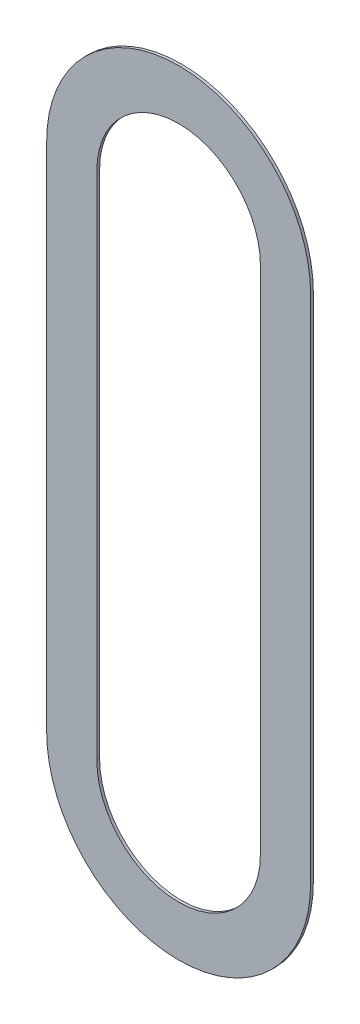
ISO-10303-21;
HEADER;
FILE_DESCRIPTION(('STEP AP214'),'2;1');
FILE_NAME('part.step','',(''),(''),'','','');
FILE_SCHEMA(('AUTOMOTIVE_DESIGN { 1 0 10303 214 1 1 1 1 }'));
ENDSEC;
DATA;
#1=APPLICATION_CONTEXT('core data for automotive mechanical design processes');
#2=APPLICATION_PROTOCOL_DEFINITION('international standard','automotive_design',2000,#1);
#3=PRODUCT_CONTEXT('',#1,'mechanical');
#4=PRODUCT('Part','Part','',(#3));
#5=PRODUCT_RELATED_PRODUCT_CATEGORY('part','',(#4));
#6=PRODUCT_DEFINITION_FORMATION('','',#4);
#7=PRODUCT_DEFINITION_CONTEXT('part definition',#1,'design');
#8=PRODUCT_DEFINITION('design','',#6,#7);
#9=PRODUCT_DEFINITION_SHAPE('','',#8);
#10=(LENGTH_UNIT() NAMED_UNIT(*) SI_UNIT(.MILLI.,.METRE.));
#11=(NAMED_UNIT(*) PLANE_ANGLE_UNIT() SI_UNIT($,.RADIAN.));
#12=(NAMED_UNIT(*) SI_UNIT($,.STERADIAN.) SOLID_ANGLE_UNIT());
#13=UNCERTAINTY_MEASURE_WITH_UNIT(LENGTH_MEASURE(1.E-05),#10,'distance_accuracy_value','');
#14=(GEOMETRIC_REPRESENTATION_CONTEXT(3) GLOBAL_UNCERTAINTY_ASSIGNED_CONTEXT((#13)) GLOBAL_UNIT_ASSIGNED_CONTEXT((#10,
#11,#12)) REPRESENTATION_CONTEXT('',''));
#15=CARTESIAN_POINT('',(0.,0.,0.));
#16=DIRECTION('',(0.,0.,1.));
#17=DIRECTION('',(1.,0.,0.));
#18=AXIS2_PLACEMENT_3D('',#15,#16,#17);
#19=CARTESIAN_POINT('',(23.6397617344236,2.37961452822477,0.));
#20=DIRECTION('',(0.,0.,-1.));
#21=DIRECTION('',(0.,-1.,0.));
#22=AXIS2_PLACEMENT_3D('',#19,#20,#21);
#23=PLANE('',#22);
#24=CARTESIAN_POINT('',(23.6397617344236,1.91565363741156,0.));
#25=DIRECTION('',(0.,0.,1.));
#26=DIRECTION('',(1.,0.,0.));
#27=AXIS2_PLACEMENT_3D('',#24,#25,#26);
#28=CIRCLE('',#27,0.148519109942367);
#29=CARTESIAN_POINT('',(23.4912426244812,1.91565363741156,0.));
#30=VERTEX_POINT('',#29);
#31=CARTESIAN_POINT('',(23.7882808443659,1.91565363741156,0.));
#32=VERTEX_POINT('',#31);
#33=EDGE_CURVE('E57',#30,#32,#28,.T.);
#34=ORIENTED_EDGE('',*,*,#33,.F.);
#35=DIRECTION('',(0.,-1.,0.));
#36=VECTOR('',#35,1.);
#37=CARTESIAN_POINT('',(23.4912426244812,1.91565363741156,0.));
#38=LINE('',#37,#36);
#39=CARTESIAN_POINT('',(23.4912426244812,2.84357541903797,0.));
#40=VERTEX_POINT('',#39);
#41=EDGE_CURVE('E19',#40,#30,#38,.T.);
#42=ORIENTED_EDGE('',*,*,#41,.F.);
#43=CARTESIAN_POINT('',(23.6397617344236,2.84357541903797,0.));
#44=DIRECTION('',(0.,0.,1.));
#45=DIRECTION('',(-1.,0.,0.));
#46=AXIS2_PLACEMENT_3D('',#43,#44,#45);
#47=CIRCLE('',#46,0.148519109942367);
#48=CARTESIAN_POINT('',(23.7882808443659,2.84357541903797,0.));
#49=VERTEX_POINT('',#48);
#50=EDGE_CURVE('E104',#49,#40,#47,.T.);
#51=ORIENTED_EDGE('',*,*,#50,.F.);
#52=DIRECTION('',(0.,1.,0.));
#53=VECTOR('',#52,1.);
#54=CARTESIAN_POINT('',(23.7882808443659,2.84357541903797,0.));
#55=LINE('',#54,#53);
#56=EDGE_CURVE('E155',#32,#49,#55,.T.);
#57=ORIENTED_EDGE('',*,*,#56,.F.);
#58=EDGE_LOOP('',(#34,#42,#51,#57));
#59=FACE_BOUND('',#58,.T.);
#60=CARTESIAN_POINT('',(23.6397617344236,1.91565363741156,0.));
#61=DIRECTION('',(0.,0.,-1.));
#62=DIRECTION('',(1.,0.,0.));
#63=AXIS2_PLACEMENT_3D('',#60,#61,#62);
#64=CIRCLE('',#63,0.239762257454337);
#65=CARTESIAN_POINT('',(23.8795239918779,1.91565363741156,0.));
#66=VERTEX_POINT('',#65);
#67=CARTESIAN_POINT('',(23.3999994769692,1.91565363741156,0.));
#68=VERTEX_POINT('',#67);
#69=EDGE_CURVE('E26',#66,#68,#64,.T.);
#70=ORIENTED_EDGE('',*,*,#69,.F.);
#71=DIRECTION('',(0.,-1.,0.));
#72=VECTOR('',#71,1.);
#73=CARTESIAN_POINT('',(23.8795239918779,2.84357541903797,0.));
#74=LINE('',#73,#72);
#75=CARTESIAN_POINT('',(23.8795239918779,2.84357541903797,0.));
#76=VERTEX_POINT('',#75);
#77=EDGE_CURVE('E146',#76,#66,#74,.T.);
#78=ORIENTED_EDGE('',*,*,#77,.F.);
#79=CARTESIAN_POINT('',(23.6397617344236,2.84357541903797,0.));
#80=DIRECTION('',(0.,0.,-1.));
#81=DIRECTION('',(-1.,0.,0.));
#82=AXIS2_PLACEMENT_3D('',#79,#80,#81);
#83=CIRCLE('',#82,0.239762257454337);
#84=CARTESIAN_POINT('',(23.3999994769692,2.84357541903797,0.));
#85=VERTEX_POINT('',#84);
#86=EDGE_CURVE('E147',#85,#76,#83,.T.);
#87=ORIENTED_EDGE('',*,*,#86,.F.);
#88=DIRECTION('',(0.,1.,0.));
#89=VECTOR('',#88,1.);
#90=CARTESIAN_POINT('',(23.3999994769692,1.91565363741156,0.));
#91=LINE('',#90,#89);
#92=EDGE_CURVE('E158',#68,#85,#91,.T.);
#93=ORIENTED_EDGE('',*,*,#92,.F.);
#94=EDGE_LOOP('',(#70,#78,#87,#93));
#95=FACE_BOUND('',#94,.T.);
#96=ADVANCED_FACE('F16',(#59,#95),#23,.F.);
#97=CARTESIAN_POINT('',(23.6397617344236,2.37961452822477,-0.005));
#98=DIRECTION('',(0.,0.,-1.));
#99=DIRECTION('',(0.,-1.,0.));
#100=AXIS2_PLACEMENT_3D('',#97,#98,#99);
#101=PLANE('',#100);
#102=CARTESIAN_POINT('',(23.6397617344236,1.91565363741156,-0.005));
#103=DIRECTION('',(0.,0.,1.));
#104=DIRECTION('',(1.,0.,0.));
#105=AXIS2_PLACEMENT_3D('',#102,#103,#104);
#106=CIRCLE('',#105,0.148519109942367);
#107=CARTESIAN_POINT('',(23.4912426244812,1.91565363741156,-0.005));
#108=VERTEX_POINT('',#107);
#109=CARTESIAN_POINT('',(23.7882808443659,1.91565363741156,-0.005));
#110=VERTEX_POINT('',#109);
#111=EDGE_CURVE('E164',#108,#110,#106,.T.);
#112=ORIENTED_EDGE('',*,*,#111,.T.);
#113=DIRECTION('',(0.,1.,0.));
#114=VECTOR('',#113,1.);
#115=CARTESIAN_POINT('',(23.7882808443659,2.84357541903797,-0.005));
#116=LINE('',#115,#114);
#117=CARTESIAN_POINT('',(23.7882808443659,2.84357541903797,-0.005));
#118=VERTEX_POINT('',#117);
#119=EDGE_CURVE('E73',#110,#118,#116,.T.);
#120=ORIENTED_EDGE('',*,*,#119,.T.);
#121=CARTESIAN_POINT('',(23.6397617344236,2.84357541903797,-0.005));
#122=DIRECTION('',(0.,0.,1.));
#123=DIRECTION('',(-1.,0.,0.));
#124=AXIS2_PLACEMENT_3D('',#121,#122,#123);
#125=CIRCLE('',#124,0.148519109942367);
#126=CARTESIAN_POINT('',(23.4912426244812,2.84357541903797,-0.005));
#127=VERTEX_POINT('',#126);
#128=EDGE_CURVE('E115',#118,#127,#125,.T.);
#129=ORIENTED_EDGE('',*,*,#128,.T.);
#130=DIRECTION('',(0.,-1.,0.));
#131=VECTOR('',#130,1.);
#132=CARTESIAN_POINT('',(23.4912426244812,1.91565363741156,-0.005));
#133=LINE('',#132,#131);
#134=EDGE_CURVE('E122',#127,#108,#133,.T.);
#135=ORIENTED_EDGE('',*,*,#134,.T.);
#136=EDGE_LOOP('',(#112,#120,#129,#135));
#137=FACE_BOUND('',#136,.T.);
#138=CARTESIAN_POINT('',(23.6397617344236,1.91565363741156,-0.005));
#139=DIRECTION('',(0.,0.,-1.));
#140=DIRECTION('',(1.,0.,0.));
#141=AXIS2_PLACEMENT_3D('',#138,#139,#140);
#142=CIRCLE('',#141,0.239762257454337);
#143=CARTESIAN_POINT('',(23.8795239918779,1.91565363741156,-0.005));
#144=VERTEX_POINT('',#143);
#145=CARTESIAN_POINT('',(23.3999994769692,1.91565363741156,-0.005));
#146=VERTEX_POINT('',#145);
#147=EDGE_CURVE('E10',#144,#146,#142,.T.);
#148=ORIENTED_EDGE('',*,*,#147,.T.);
#149=DIRECTION('',(0.,1.,0.));
#150=VECTOR('',#149,1.);
#151=CARTESIAN_POINT('',(23.3999994769692,1.91565363741156,-0.005));
#152=LINE('',#151,#150);
#153=CARTESIAN_POINT('',(23.3999994769692,2.84357541903797,-0.005));
#154=VERTEX_POINT('',#153);
#155=EDGE_CURVE('E156',#146,#154,#152,.T.);
#156=ORIENTED_EDGE('',*,*,#155,.T.);
#157=CARTESIAN_POINT('',(23.6397617344236,2.84357541903797,-0.005));
#158=DIRECTION('',(0.,0.,-1.));
#159=DIRECTION('',(-1.,0.,0.));
#160=AXIS2_PLACEMENT_3D('',#157,#158,#159);
#161=CIRCLE('',#160,0.239762257454337);
#162=CARTESIAN_POINT('',(23.8795239918779,2.84357541903797,-0.005));
#163=VERTEX_POINT('',#162);
#164=EDGE_CURVE('E150',#154,#163,#161,.T.);
#165=ORIENTED_EDGE('',*,*,#164,.T.);
#166=DIRECTION('',(0.,-1.,0.));
#167=VECTOR('',#166,1.);
#168=CARTESIAN_POINT('',(23.8795239918779,2.84357541903797,-0.005));
#169=LINE('',#168,#167);
#170=EDGE_CURVE('E145',#163,#144,#169,.T.);
#171=ORIENTED_EDGE('',*,*,#170,.T.);
#172=EDGE_LOOP('',(#148,#156,#165,#171));
#173=FACE_BOUND('',#172,.T.);
#174=ADVANCED_FACE('F192',(#137,#173),#101,.T.);
#175=CARTESIAN_POINT('',(23.6397617344236,1.91565363741156,0.));
#176=DIRECTION('',(0.,0.,-1.));
#177=DIRECTION('',(1.,0.,0.));
#178=AXIS2_PLACEMENT_3D('',#175,#176,#177);
#179=CYLINDRICAL_SURFACE('',#178,0.239762257454337);
#180=ORIENTED_EDGE('',*,*,#69,.T.);
#181=DIRECTION('',(0.,0.,-1.));
#182=VECTOR('',#181,1.);
#183=CARTESIAN_POINT('',(23.3999994769692,1.91565363741156,0.));
#184=LINE('',#183,#182);
#185=EDGE_CURVE('E138',#68,#146,#184,.T.);
#186=ORIENTED_EDGE('',*,*,#185,.T.);
#187=ORIENTED_EDGE('',*,*,#147,.F.);
#188=DIRECTION('',(0.,0.,-1.));
#189=VECTOR('',#188,1.);
#190=CARTESIAN_POINT('',(23.8795239918779,1.91565363741156,0.));
#191=LINE('',#190,#189);
#192=EDGE_CURVE('E141',#66,#144,#191,.T.);
#193=ORIENTED_EDGE('',*,*,#192,.F.);
#194=EDGE_LOOP('',(#180,#186,#187,#193));
#195=FACE_BOUND('',#194,.T.);
#196=ADVANCED_FACE('F239',(#195),#179,.T.);
#197=CARTESIAN_POINT('',(23.3999994769692,1.91565363741156,0.));
#198=DIRECTION('',(-1.,0.,0.));
#199=DIRECTION('',(0.,0.,1.));
#200=AXIS2_PLACEMENT_3D('',#197,#198,#199);
#201=PLANE('',#200);
#202=ORIENTED_EDGE('',*,*,#92,.T.);
#203=DIRECTION('',(0.,0.,-1.));
#204=VECTOR('',#203,1.);
#205=CARTESIAN_POINT('',(23.3999994769692,2.84357541903797,0.));
#206=LINE('',#205,#204);
#207=EDGE_CURVE('E175',#85,#154,#206,.T.);
#208=ORIENTED_EDGE('',*,*,#207,.T.);
#209=ORIENTED_EDGE('',*,*,#155,.F.);
#210=ORIENTED_EDGE('',*,*,#185,.F.);
#211=EDGE_LOOP('',(#202,#208,#209,#210));
#212=FACE_BOUND('',#211,.T.);
#213=ADVANCED_FACE('F259',(#212),#201,.T.);
#214=CARTESIAN_POINT('',(23.6397617344236,2.84357541903797,0.));
#215=DIRECTION('',(0.,0.,-1.));
#216=DIRECTION('',(-1.,0.,0.));
#217=AXIS2_PLACEMENT_3D('',#214,#215,#216);
#218=CYLINDRICAL_SURFACE('',#217,0.239762257454337);
#219=ORIENTED_EDGE('',*,*,#86,.T.);
#220=DIRECTION('',(0.,0.,-1.));
#221=VECTOR('',#220,1.);
#222=CARTESIAN_POINT('',(23.8795239918779,2.84357541903797,0.));
#223=LINE('',#222,#221);
#224=EDGE_CURVE('E151',#76,#163,#223,.T.);
#225=ORIENTED_EDGE('',*,*,#224,.T.);
#226=ORIENTED_EDGE('',*,*,#164,.F.);
#227=ORIENTED_EDGE('',*,*,#207,.F.);
#228=EDGE_LOOP('',(#219,#225,#226,#227));
#229=FACE_BOUND('',#228,.T.);
#230=ADVANCED_FACE('F270',(#229),#218,.T.);
#231=CARTESIAN_POINT('',(23.8795239918779,2.84357541903797,0.));
#232=DIRECTION('',(1.,0.,0.));
#233=DIRECTION('',(0.,1.,0.));
#234=AXIS2_PLACEMENT_3D('',#231,#232,#233);
#235=PLANE('',#234);
#236=ORIENTED_EDGE('',*,*,#77,.T.);
#237=ORIENTED_EDGE('',*,*,#192,.T.);
#238=ORIENTED_EDGE('',*,*,#170,.F.);
#239=ORIENTED_EDGE('',*,*,#224,.F.);
#240=EDGE_LOOP('',(#236,#237,#238,#239));
#241=FACE_BOUND('',#240,.T.);
#242=ADVANCED_FACE('F281',(#241),#235,.T.);
#243=CARTESIAN_POINT('',(23.6397617344236,1.91565363741156,0.));
#244=DIRECTION('',(0.,0.,-1.));
#245=DIRECTION('',(1.,0.,0.));
#246=AXIS2_PLACEMENT_3D('',#243,#244,#245);
#247=CYLINDRICAL_SURFACE('',#246,0.148519109942367);
#248=ORIENTED_EDGE('',*,*,#33,.T.);
#249=DIRECTION('',(0.,0.,-1.));
#250=VECTOR('',#249,1.);
#251=CARTESIAN_POINT('',(23.7882808443659,1.91565363741156,0.));
#252=LINE('',#251,#250);
#253=EDGE_CURVE('E154',#32,#110,#252,.T.);
#254=ORIENTED_EDGE('',*,*,#253,.T.);
#255=ORIENTED_EDGE('',*,*,#111,.F.);
#256=DIRECTION('',(0.,0.,-1.));
#257=VECTOR('',#256,1.);
#258=CARTESIAN_POINT('',(23.4912426244812,1.91565363741156,0.));
#259=LINE('',#258,#257);
#260=EDGE_CURVE('E127',#30,#108,#259,.T.);
#261=ORIENTED_EDGE('',*,*,#260,.F.);
#262=EDGE_LOOP('',(#248,#254,#255,#261));
#263=FACE_BOUND('',#262,.T.);
#264=ADVANCED_FACE('F188',(#263),#247,.F.);
#265=CARTESIAN_POINT('',(23.7882808443659,1.91565363741156,0.));
#266=DIRECTION('',(-1.,0.,0.));
#267=DIRECTION('',(0.,0.,1.));
#268=AXIS2_PLACEMENT_3D('',#265,#266,#267);
#269=PLANE('',#268);
#270=ORIENTED_EDGE('',*,*,#56,.T.);
#271=DIRECTION('',(0.,0.,-1.));
#272=VECTOR('',#271,1.);
#273=CARTESIAN_POINT('',(23.7882808443659,2.84357541903797,0.));
#274=LINE('',#273,#272);
#275=EDGE_CURVE('E110',#49,#118,#274,.T.);
#276=ORIENTED_EDGE('',*,*,#275,.T.);
#277=ORIENTED_EDGE('',*,*,#119,.F.);
#278=ORIENTED_EDGE('',*,*,#253,.F.);
#279=EDGE_LOOP('',(#270,#276,#277,#278));
#280=FACE_BOUND('',#279,.T.);
#281=ADVANCED_FACE('F190',(#280),#269,.T.);
#282=CARTESIAN_POINT('',(23.6397617344236,2.84357541903797,0.));
#283=DIRECTION('',(0.,0.,-1.));
#284=DIRECTION('',(-1.,0.,0.));
#285=AXIS2_PLACEMENT_3D('',#282,#283,#284);
#286=CYLINDRICAL_SURFACE('',#285,0.148519109942367);
#287=ORIENTED_EDGE('',*,*,#50,.T.);
#288=DIRECTION('',(0.,0.,-1.));
#289=VECTOR('',#288,1.);
#290=CARTESIAN_POINT('',(23.4912426244812,2.84357541903797,0.));
#291=LINE('',#290,#289);
#292=EDGE_CURVE('E108',#40,#127,#291,.T.);
#293=ORIENTED_EDGE('',*,*,#292,.T.);
#294=ORIENTED_EDGE('',*,*,#128,.F.);
#295=ORIENTED_EDGE('',*,*,#275,.F.);
#296=EDGE_LOOP('',(#287,#293,#294,#295));
#297=FACE_BOUND('',#296,.T.);
#298=ADVANCED_FACE('F106',(#297),#286,.F.);
#299=CARTESIAN_POINT('',(23.4912426244812,2.84357541903797,0.));
#300=DIRECTION('',(1.,0.,0.));
#301=DIRECTION('',(0.,1.,0.));
#302=AXIS2_PLACEMENT_3D('',#299,#300,#301);
#303=PLANE('',#302);
#304=ORIENTED_EDGE('',*,*,#41,.T.);
#305=ORIENTED_EDGE('',*,*,#260,.T.);
#306=ORIENTED_EDGE('',*,*,#134,.F.);
#307=ORIENTED_EDGE('',*,*,#292,.F.);
#308=EDGE_LOOP('',(#304,#305,#306,#307));
#309=FACE_BOUND('',#308,.T.);
#310=ADVANCED_FACE('F119',(#309),#303,.T.);
#311=CLOSED_SHELL('',(#96,#174,#196,#213,#230,#242,#264,#281,#298,#310));
#312=MANIFOLD_SOLID_BREP('B1',#311);
#313=ADVANCED_BREP_SHAPE_REPRESENTATION('',(#18,#312),#14);
#314=SHAPE_DEFINITION_REPRESENTATION(#9,#313);
ENDSEC;
END-ISO-10303-21;
